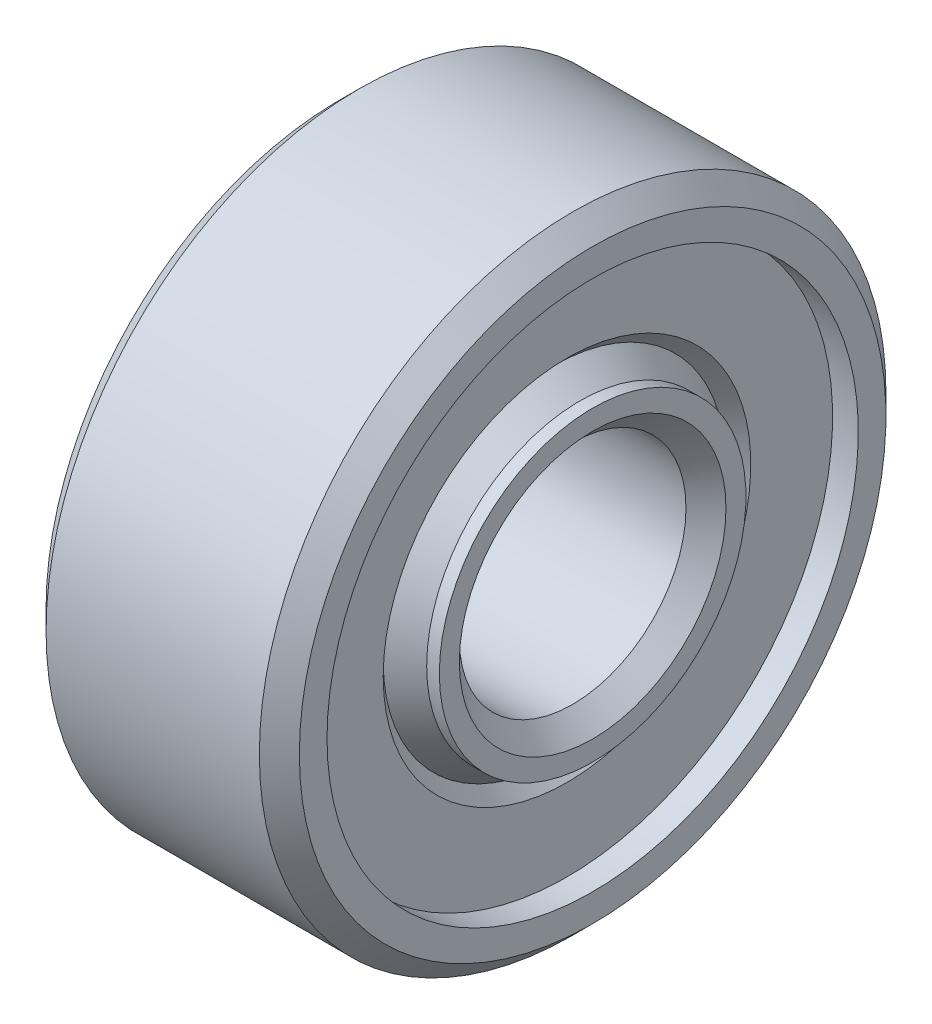
ISO-10303-21;
HEADER;
FILE_DESCRIPTION(('STEP AP214'),'2;1');
FILE_NAME('part.step','',(''),(''),'','','');
FILE_SCHEMA(('AUTOMOTIVE_DESIGN { 1 0 10303 214 1 1 1 1 }'));
ENDSEC;
DATA;
#1=APPLICATION_CONTEXT('core data for automotive mechanical design processes');
#2=APPLICATION_PROTOCOL_DEFINITION('international standard','automotive_design',2000,#1);
#3=PRODUCT_CONTEXT('',#1,'mechanical');
#4=PRODUCT('Part','Part','',(#3));
#5=PRODUCT_RELATED_PRODUCT_CATEGORY('part','',(#4));
#6=PRODUCT_DEFINITION_FORMATION('','',#4);
#7=PRODUCT_DEFINITION_CONTEXT('part definition',#1,'design');
#8=PRODUCT_DEFINITION('design','',#6,#7);
#9=PRODUCT_DEFINITION_SHAPE('','',#8);
#10=(LENGTH_UNIT() NAMED_UNIT(*) SI_UNIT(.MILLI.,.METRE.));
#11=(NAMED_UNIT(*) PLANE_ANGLE_UNIT() SI_UNIT($,.RADIAN.));
#12=(NAMED_UNIT(*) SI_UNIT($,.STERADIAN.) SOLID_ANGLE_UNIT());
#13=UNCERTAINTY_MEASURE_WITH_UNIT(LENGTH_MEASURE(1.E-05),#10,'distance_accuracy_value','');
#14=(GEOMETRIC_REPRESENTATION_CONTEXT(3) GLOBAL_UNCERTAINTY_ASSIGNED_CONTEXT((#13)) GLOBAL_UNIT_ASSIGNED_CONTEXT((#10,
#11,#12)) REPRESENTATION_CONTEXT('',''));
#15=CARTESIAN_POINT('',(0.,0.,0.));
#16=DIRECTION('',(0.,0.,1.));
#17=DIRECTION('',(1.,0.,0.));
#18=AXIS2_PLACEMENT_3D('',#15,#16,#17);
#19=CARTESIAN_POINT('',(16.125,-2.97038840172337,0.));
#20=DIRECTION('',(1.,0.,0.));
#21=DIRECTION('',(0.,0.,-1.));
#22=AXIS2_PLACEMENT_3D('',#19,#20,#21);
#23=PLANE('',#22);
#24=CARTESIAN_POINT('',(16.125,0.,0.));
#25=DIRECTION('',(-1.,0.,0.));
#26=DIRECTION('',(0.,0.,1.));
#27=AXIS2_PLACEMENT_3D('',#24,#25,#26);
#28=CIRCLE('',#27,12.8352601156069);
#29=CARTESIAN_POINT('',(16.125,0.,12.8352601156069));
#30=VERTEX_POINT('',#29);
#31=EDGE_CURVE('E11',#30,#30,#28,.T.);
#32=ORIENTED_EDGE('',*,*,#31,.F.);
#33=EDGE_LOOP('',(#32));
#34=FACE_BOUND('',#33,.T.);
#35=CARTESIAN_POINT('',(16.125,0.,0.));
#36=DIRECTION('',(-1.,0.,0.));
#37=DIRECTION('',(0.,0.,1.));
#38=AXIS2_PLACEMENT_3D('',#35,#36,#37);
#39=CIRCLE('',#38,19.925);
#40=CARTESIAN_POINT('',(16.125,0.,19.925));
#41=VERTEX_POINT('',#40);
#42=EDGE_CURVE('E55',#41,#41,#39,.T.);
#43=ORIENTED_EDGE('',*,*,#42,.T.);
#44=EDGE_LOOP('',(#43));
#45=FACE_BOUND('',#44,.T.);
#46=ADVANCED_FACE('F41',(#34,#45),#23,.F.);
#47=CARTESIAN_POINT('',(16.125,0.,0.));
#48=DIRECTION('',(1.,0.,0.));
#49=DIRECTION('',(0.,0.,-1.));
#50=AXIS2_PLACEMENT_3D('',#47,#48,#49);
#51=CONICAL_SURFACE('',#50,12.8352601156069,0.785398163397454);
#52=CARTESIAN_POINT('',(17.075,0.,0.));
#53=DIRECTION('',(-1.,0.,0.));
#54=DIRECTION('',(0.,0.,1.));
#55=AXIS2_PLACEMENT_3D('',#52,#53,#54);
#56=CIRCLE('',#55,13.785260115607);
#57=CARTESIAN_POINT('',(17.075,0.,13.785260115607));
#58=VERTEX_POINT('',#57);
#59=EDGE_CURVE('E47',#58,#58,#56,.T.);
#60=ORIENTED_EDGE('',*,*,#59,.F.);
#61=EDGE_LOOP('',(#60));
#62=FACE_BOUND('',#61,.T.);
#63=ORIENTED_EDGE('',*,*,#31,.T.);
#64=EDGE_LOOP('',(#63));
#65=FACE_BOUND('',#64,.T.);
#66=ADVANCED_FACE('F70',(#62,#65),#51,.F.);
#67=CARTESIAN_POINT('',(17.075,-2.97038840172337,0.));
#68=DIRECTION('',(1.,0.,0.));
#69=DIRECTION('',(0.,0.,-1.));
#70=AXIS2_PLACEMENT_3D('',#67,#68,#69);
#71=PLANE('',#70);
#72=ORIENTED_EDGE('',*,*,#59,.T.);
#73=EDGE_LOOP('',(#72));
#74=FACE_BOUND('',#73,.T.);
#75=CARTESIAN_POINT('',(17.075,0.,0.));
#76=DIRECTION('',(-1.,0.,0.));
#77=DIRECTION('',(0.,0.,1.));
#78=AXIS2_PLACEMENT_3D('',#75,#76,#77);
#79=CIRCLE('',#78,19.925);
#80=CARTESIAN_POINT('',(17.075,0.,19.925));
#81=VERTEX_POINT('',#80);
#82=EDGE_CURVE('E51',#81,#81,#79,.T.);
#83=ORIENTED_EDGE('',*,*,#82,.F.);
#84=EDGE_LOOP('',(#83));
#85=FACE_BOUND('',#84,.T.);
#86=ADVANCED_FACE('F64',(#74,#85),#71,.T.);
#87=CARTESIAN_POINT('',(0.,0.,0.));
#88=DIRECTION('',(-1.,0.,0.));
#89=DIRECTION('',(0.,0.,1.));
#90=AXIS2_PLACEMENT_3D('',#87,#88,#89);
#91=CYLINDRICAL_SURFACE('',#90,19.925);
#92=ORIENTED_EDGE('',*,*,#82,.T.);
#93=EDGE_LOOP('',(#92));
#94=FACE_BOUND('',#93,.T.);
#95=ORIENTED_EDGE('',*,*,#42,.F.);
#96=EDGE_LOOP('',(#95));
#97=FACE_BOUND('',#96,.T.);
#98=ADVANCED_FACE('F62',(#94,#97),#91,.T.);
#99=CLOSED_SHELL('',(#46,#66,#86,#98));
#100=MANIFOLD_SOLID_BREP('B2',#99);
#101=CARTESIAN_POINT('',(2.875,-2.97038840172337,0.));
#102=DIRECTION('',(1.,0.,0.));
#103=DIRECTION('',(0.,0.,-1.));
#104=AXIS2_PLACEMENT_3D('',#101,#102,#103);
#105=PLANE('',#104);
#106=CARTESIAN_POINT('',(2.875,0.,0.));
#107=DIRECTION('',(-1.,0.,0.));
#108=DIRECTION('',(0.,0.,1.));
#109=AXIS2_PLACEMENT_3D('',#106,#107,#108);
#110=CIRCLE('',#109,12.8352601156069);
#111=CARTESIAN_POINT('',(2.875,0.,12.8352601156069));
#112=VERTEX_POINT('',#111);
#113=EDGE_CURVE('E128',#112,#112,#110,.T.);
#114=ORIENTED_EDGE('',*,*,#113,.T.);
#115=EDGE_LOOP('',(#114));
#116=FACE_BOUND('',#115,.T.);
#117=CARTESIAN_POINT('',(2.875,0.,0.));
#118=DIRECTION('',(-1.,0.,0.));
#119=DIRECTION('',(0.,0.,1.));
#120=AXIS2_PLACEMENT_3D('',#117,#118,#119);
#121=CIRCLE('',#120,19.925);
#122=CARTESIAN_POINT('',(2.875,0.,19.925));
#123=VERTEX_POINT('',#122);
#124=EDGE_CURVE('E40',#123,#123,#121,.T.);
#125=ORIENTED_EDGE('',*,*,#124,.F.);
#126=EDGE_LOOP('',(#125));
#127=FACE_BOUND('',#126,.T.);
#128=ADVANCED_FACE('F114',(#116,#127),#105,.T.);
#129=CARTESIAN_POINT('',(0.,0.,0.));
#130=DIRECTION('',(-1.,0.,0.));
#131=DIRECTION('',(0.,0.,1.));
#132=AXIS2_PLACEMENT_3D('',#129,#130,#131);
#133=CYLINDRICAL_SURFACE('',#132,19.925);
#134=ORIENTED_EDGE('',*,*,#124,.T.);
#135=EDGE_LOOP('',(#134));
#136=FACE_BOUND('',#135,.T.);
#137=CARTESIAN_POINT('',(1.925,0.,0.));
#138=DIRECTION('',(-1.,0.,0.));
#139=DIRECTION('',(0.,0.,1.));
#140=AXIS2_PLACEMENT_3D('',#137,#138,#139);
#141=CIRCLE('',#140,19.925);
#142=CARTESIAN_POINT('',(1.925,0.,19.925));
#143=VERTEX_POINT('',#142);
#144=EDGE_CURVE('E120',#143,#143,#141,.T.);
#145=ORIENTED_EDGE('',*,*,#144,.F.);
#146=EDGE_LOOP('',(#145));
#147=FACE_BOUND('',#146,.T.);
#148=ADVANCED_FACE('F144',(#136,#147),#133,.T.);
#149=CARTESIAN_POINT('',(1.925,-2.97038840172337,0.));
#150=DIRECTION('',(1.,0.,0.));
#151=DIRECTION('',(0.,0.,-1.));
#152=AXIS2_PLACEMENT_3D('',#149,#150,#151);
#153=PLANE('',#152);
#154=CARTESIAN_POINT('',(1.925,0.,0.));
#155=DIRECTION('',(-1.,0.,0.));
#156=DIRECTION('',(0.,0.,1.));
#157=AXIS2_PLACEMENT_3D('',#154,#155,#156);
#158=CIRCLE('',#157,13.785260115607);
#159=CARTESIAN_POINT('',(1.925,0.,13.785260115607));
#160=VERTEX_POINT('',#159);
#161=EDGE_CURVE('E124',#160,#160,#158,.T.);
#162=ORIENTED_EDGE('',*,*,#161,.F.);
#163=EDGE_LOOP('',(#162));
#164=FACE_BOUND('',#163,.T.);
#165=ORIENTED_EDGE('',*,*,#144,.T.);
#166=EDGE_LOOP('',(#165));
#167=FACE_BOUND('',#166,.T.);
#168=ADVANCED_FACE('F139',(#164,#167),#153,.F.);
#169=CARTESIAN_POINT('',(1.925,0.,0.));
#170=DIRECTION('',(-1.,0.,0.));
#171=DIRECTION('',(0.,0.,1.));
#172=AXIS2_PLACEMENT_3D('',#169,#170,#171);
#173=CONICAL_SURFACE('',#172,13.785260115607,0.785398163397457);
#174=ORIENTED_EDGE('',*,*,#113,.F.);
#175=EDGE_LOOP('',(#174));
#176=FACE_BOUND('',#175,.T.);
#177=ORIENTED_EDGE('',*,*,#161,.T.);
#178=EDGE_LOOP('',(#177));
#179=FACE_BOUND('',#178,.T.);
#180=ADVANCED_FACE('F136',(#176,#179),#173,.F.);
#181=CLOSED_SHELL('',(#128,#148,#168,#180));
#182=MANIFOLD_SOLID_BREP('B6',#181);
#183=CARTESIAN_POINT('',(9.5,0.,0.));
#184=DIRECTION('',(-1.,0.,0.));
#185=DIRECTION('',(0.,0.,1.));
#186=AXIS2_PLACEMENT_3D('',#183,#184,#185);
#187=TOROIDAL_SURFACE('',#186,16.,3.75);
#188=CARTESIAN_POINT('',(9.5,0.,19.75));
#189=VERTEX_POINT('',#188);
#190=VERTEX_LOOP('',#189);
#191=FACE_BOUND('',#190,.T.);
#192=ADVANCED_FACE('F189',(#191),#187,.T.);
#193=CLOSED_SHELL('',(#192));
#194=MANIFOLD_SOLID_BREP('B35',#193);
#195=CARTESIAN_POINT('',(9.5,0.,0.));
#196=DIRECTION('',(-1.,0.,0.));
#197=DIRECTION('',(0.,0.,1.));
#198=AXIS2_PLACEMENT_3D('',#195,#196,#197);
#199=TOROIDAL_SURFACE('',#198,16.,3.75);
#200=CARTESIAN_POINT('',(12.2950849718747,0.,0.));
#201=DIRECTION('',(-1.,0.,0.));
#202=DIRECTION('',(0.,0.,1.));
#203=AXIS2_PLACEMENT_3D('',#200,#201,#202);
#204=CIRCLE('',#203,13.5);
#205=CARTESIAN_POINT('',(12.2950849718747,0.,13.5));
#206=VERTEX_POINT('',#205);
#207=EDGE_CURVE('E254',#206,#206,#204,.T.);
#208=ORIENTED_EDGE('',*,*,#207,.T.);
#209=EDGE_LOOP('',(#208));
#210=FACE_BOUND('',#209,.T.);
#211=CARTESIAN_POINT('',(6.70491502812526,0.,0.));
#212=DIRECTION('',(-1.,0.,0.));
#213=DIRECTION('',(0.,0.,1.));
#214=AXIS2_PLACEMENT_3D('',#211,#212,#213);
#215=CIRCLE('',#214,13.5);
#216=CARTESIAN_POINT('',(6.70491502812526,0.,13.5));
#217=VERTEX_POINT('',#216);
#218=EDGE_CURVE('E188',#217,#217,#215,.T.);
#219=ORIENTED_EDGE('',*,*,#218,.F.);
#220=EDGE_LOOP('',(#219));
#221=FACE_BOUND('',#220,.T.);
#222=ADVANCED_FACE('F214',(#210,#221),#199,.F.);
#223=CARTESIAN_POINT('',(0.,0.,0.));
#224=DIRECTION('',(-1.,0.,0.));
#225=DIRECTION('',(0.,0.,1.));
#226=AXIS2_PLACEMENT_3D('',#223,#224,#225);
#227=CYLINDRICAL_SURFACE('',#226,13.5);
#228=ORIENTED_EDGE('',*,*,#218,.T.);
#229=EDGE_LOOP('',(#228));
#230=FACE_BOUND('',#229,.T.);
#231=CARTESIAN_POINT('',(3.83333333333333,0.,0.));
#232=DIRECTION('',(-1.,0.,0.));
#233=DIRECTION('',(0.,0.,1.));
#234=AXIS2_PLACEMENT_3D('',#231,#232,#233);
#235=CIRCLE('',#234,13.5);
#236=CARTESIAN_POINT('',(3.83333333333333,0.,13.5));
#237=VERTEX_POINT('',#236);
#238=EDGE_CURVE('E220',#237,#237,#235,.T.);
#239=ORIENTED_EDGE('',*,*,#238,.F.);
#240=EDGE_LOOP('',(#239));
#241=FACE_BOUND('',#240,.T.);
#242=ADVANCED_FACE('F272',(#230,#241),#227,.T.);
#243=CARTESIAN_POINT('',(0.949999999999999,0.,0.));
#244=DIRECTION('',(1.,0.,0.));
#245=DIRECTION('',(0.,0.,-1.));
#246=AXIS2_PLACEMENT_3D('',#243,#244,#245);
#247=CONICAL_SURFACE('',#246,11.5,0.606445834884001);
#248=ORIENTED_EDGE('',*,*,#238,.T.);
#249=EDGE_LOOP('',(#248));
#250=FACE_BOUND('',#249,.T.);
#251=CARTESIAN_POINT('',(0.949999999999999,0.,0.));
#252=DIRECTION('',(-1.,0.,0.));
#253=DIRECTION('',(0.,0.,1.));
#254=AXIS2_PLACEMENT_3D('',#251,#252,#253);
#255=CIRCLE('',#254,11.5);
#256=CARTESIAN_POINT('',(0.949999999999999,0.,11.5));
#257=VERTEX_POINT('',#256);
#258=EDGE_CURVE('E224',#257,#257,#255,.T.);
#259=ORIENTED_EDGE('',*,*,#258,.F.);
#260=EDGE_LOOP('',(#259));
#261=FACE_BOUND('',#260,.T.);
#262=ADVANCED_FACE('F276',(#250,#261),#247,.T.);
#263=CARTESIAN_POINT('',(0.,0.,0.));
#264=DIRECTION('',(-1.,0.,0.));
#265=DIRECTION('',(0.,0.,1.));
#266=AXIS2_PLACEMENT_3D('',#263,#264,#265);
#267=CYLINDRICAL_SURFACE('',#266,11.5);
#268=ORIENTED_EDGE('',*,*,#258,.T.);
#269=EDGE_LOOP('',(#268));
#270=FACE_BOUND('',#269,.T.);
#271=CARTESIAN_POINT('',(0.,0.,0.));
#272=DIRECTION('',(-1.,0.,0.));
#273=DIRECTION('',(0.,0.,1.));
#274=AXIS2_PLACEMENT_3D('',#271,#272,#273);
#275=CIRCLE('',#274,11.5);
#276=CARTESIAN_POINT('',(0.,0.,11.5));
#277=VERTEX_POINT('',#276);
#278=EDGE_CURVE('E228',#277,#277,#275,.T.);
#279=ORIENTED_EDGE('',*,*,#278,.F.);
#280=EDGE_LOOP('',(#279));
#281=FACE_BOUND('',#280,.T.);
#282=ADVANCED_FACE('F280',(#270,#281),#267,.T.);
#283=CARTESIAN_POINT('',(0.,-2.97038840172337,0.));
#284=DIRECTION('',(-1.,0.,0.));
#285=DIRECTION('',(0.,0.,1.));
#286=AXIS2_PLACEMENT_3D('',#283,#284,#285);
#287=PLANE('',#286);
#288=ORIENTED_EDGE('',*,*,#278,.T.);
#289=EDGE_LOOP('',(#288));
#290=FACE_BOUND('',#289,.T.);
#291=CARTESIAN_POINT('',(0.,0.,0.));
#292=DIRECTION('',(-1.,0.,0.));
#293=DIRECTION('',(0.,0.,1.));
#294=AXIS2_PLACEMENT_3D('',#291,#292,#293);
#295=CIRCLE('',#294,9.99999999999999);
#296=CARTESIAN_POINT('',(0.,0.,9.99999999999999));
#297=VERTEX_POINT('',#296);
#298=EDGE_CURVE('E233',#297,#297,#295,.T.);
#299=ORIENTED_EDGE('',*,*,#298,.F.);
#300=EDGE_LOOP('',(#299));
#301=FACE_BOUND('',#300,.T.);
#302=ADVANCED_FACE('F286',(#290,#301),#287,.T.);
#303=CARTESIAN_POINT('',(0.,0.,0.));
#304=DIRECTION('',(-1.,0.,0.));
#305=DIRECTION('',(0.,0.,1.));
#306=AXIS2_PLACEMENT_3D('',#303,#304,#305);
#307=CONICAL_SURFACE('',#306,9.99999999999999,0.785398163397447);
#308=CARTESIAN_POINT('',(1.5,0.,0.));
#309=DIRECTION('',(-1.,0.,0.));
#310=DIRECTION('',(0.,0.,1.));
#311=AXIS2_PLACEMENT_3D('',#308,#309,#310);
#312=CIRCLE('',#311,8.5);
#313=CARTESIAN_POINT('',(1.5,0.,8.5));
#314=VERTEX_POINT('',#313);
#315=EDGE_CURVE('E236',#314,#314,#312,.T.);
#316=ORIENTED_EDGE('',*,*,#315,.F.);
#317=EDGE_LOOP('',(#316));
#318=FACE_BOUND('',#317,.T.);
#319=ORIENTED_EDGE('',*,*,#298,.T.);
#320=EDGE_LOOP('',(#319));
#321=FACE_BOUND('',#320,.T.);
#322=ADVANCED_FACE('F290',(#318,#321),#307,.F.);
#323=CARTESIAN_POINT('',(0.,0.,0.));
#324=DIRECTION('',(-1.,0.,0.));
#325=DIRECTION('',(0.,0.,1.));
#326=AXIS2_PLACEMENT_3D('',#323,#324,#325);
#327=CYLINDRICAL_SURFACE('',#326,8.5);
#328=CARTESIAN_POINT('',(17.5,0.,0.));
#329=DIRECTION('',(-1.,0.,0.));
#330=DIRECTION('',(0.,0.,1.));
#331=AXIS2_PLACEMENT_3D('',#328,#329,#330);
#332=CIRCLE('',#331,8.5);
#333=CARTESIAN_POINT('',(17.5,0.,8.5));
#334=VERTEX_POINT('',#333);
#335=EDGE_CURVE('E239',#334,#334,#332,.T.);
#336=ORIENTED_EDGE('',*,*,#335,.F.);
#337=EDGE_LOOP('',(#336));
#338=FACE_BOUND('',#337,.T.);
#339=ORIENTED_EDGE('',*,*,#315,.T.);
#340=EDGE_LOOP('',(#339));
#341=FACE_BOUND('',#340,.T.);
#342=ADVANCED_FACE('F294',(#338,#341),#327,.F.);
#343=CARTESIAN_POINT('',(17.5,0.,0.));
#344=DIRECTION('',(1.,0.,0.));
#345=DIRECTION('',(0.,0.,-1.));
#346=AXIS2_PLACEMENT_3D('',#343,#344,#345);
#347=CONICAL_SURFACE('',#346,8.5,0.78539816339745);
#348=CARTESIAN_POINT('',(19.,0.,0.));
#349=DIRECTION('',(-1.,0.,0.));
#350=DIRECTION('',(0.,0.,1.));
#351=AXIS2_PLACEMENT_3D('',#348,#349,#350);
#352=CIRCLE('',#351,10.);
#353=CARTESIAN_POINT('',(19.,0.,10.));
#354=VERTEX_POINT('',#353);
#355=EDGE_CURVE('E242',#354,#354,#352,.T.);
#356=ORIENTED_EDGE('',*,*,#355,.F.);
#357=EDGE_LOOP('',(#356));
#358=FACE_BOUND('',#357,.T.);
#359=ORIENTED_EDGE('',*,*,#335,.T.);
#360=EDGE_LOOP('',(#359));
#361=FACE_BOUND('',#360,.T.);
#362=ADVANCED_FACE('F298',(#358,#361),#347,.F.);
#363=CARTESIAN_POINT('',(19.,-2.97038840172337,0.));
#364=DIRECTION('',(-1.,0.,0.));
#365=DIRECTION('',(0.,0.,1.));
#366=AXIS2_PLACEMENT_3D('',#363,#364,#365);
#367=PLANE('',#366);
#368=CARTESIAN_POINT('',(19.,0.,0.));
#369=DIRECTION('',(-1.,0.,0.));
#370=DIRECTION('',(0.,0.,1.));
#371=AXIS2_PLACEMENT_3D('',#368,#369,#370);
#372=CIRCLE('',#371,11.5);
#373=CARTESIAN_POINT('',(19.,0.,11.5));
#374=VERTEX_POINT('',#373);
#375=EDGE_CURVE('E245',#374,#374,#372,.T.);
#376=ORIENTED_EDGE('',*,*,#375,.F.);
#377=EDGE_LOOP('',(#376));
#378=FACE_BOUND('',#377,.T.);
#379=ORIENTED_EDGE('',*,*,#355,.T.);
#380=EDGE_LOOP('',(#379));
#381=FACE_BOUND('',#380,.T.);
#382=ADVANCED_FACE('F302',(#378,#381),#367,.F.);
#383=CARTESIAN_POINT('',(0.,0.,0.));
#384=DIRECTION('',(-1.,0.,0.));
#385=DIRECTION('',(0.,0.,1.));
#386=AXIS2_PLACEMENT_3D('',#383,#384,#385);
#387=CYLINDRICAL_SURFACE('',#386,11.5);
#388=ORIENTED_EDGE('',*,*,#375,.T.);
#389=EDGE_LOOP('',(#388));
#390=FACE_BOUND('',#389,.T.);
#391=CARTESIAN_POINT('',(18.05,0.,0.));
#392=DIRECTION('',(-1.,0.,0.));
#393=DIRECTION('',(0.,0.,1.));
#394=AXIS2_PLACEMENT_3D('',#391,#392,#393);
#395=CIRCLE('',#394,11.5);
#396=CARTESIAN_POINT('',(18.05,0.,11.5));
#397=VERTEX_POINT('',#396);
#398=EDGE_CURVE('E248',#397,#397,#395,.T.);
#399=ORIENTED_EDGE('',*,*,#398,.F.);
#400=EDGE_LOOP('',(#399));
#401=FACE_BOUND('',#400,.T.);
#402=ADVANCED_FACE('F268',(#390,#401),#387,.T.);
#403=CARTESIAN_POINT('',(15.1666666666667,0.,0.));
#404=DIRECTION('',(-1.,0.,0.));
#405=DIRECTION('',(0.,0.,1.));
#406=AXIS2_PLACEMENT_3D('',#403,#404,#405);
#407=CONICAL_SURFACE('',#406,13.5,0.606445834884);
#408=ORIENTED_EDGE('',*,*,#398,.T.);
#409=EDGE_LOOP('',(#408));
#410=FACE_BOUND('',#409,.T.);
#411=CARTESIAN_POINT('',(15.1666666666667,0.,0.));
#412=DIRECTION('',(-1.,0.,0.));
#413=DIRECTION('',(0.,0.,1.));
#414=AXIS2_PLACEMENT_3D('',#411,#412,#413);
#415=CIRCLE('',#414,13.5);
#416=CARTESIAN_POINT('',(15.1666666666667,0.,13.5));
#417=VERTEX_POINT('',#416);
#418=EDGE_CURVE('E251',#417,#417,#415,.T.);
#419=ORIENTED_EDGE('',*,*,#418,.F.);
#420=EDGE_LOOP('',(#419));
#421=FACE_BOUND('',#420,.T.);
#422=ADVANCED_FACE('F262',(#410,#421),#407,.T.);
#423=CARTESIAN_POINT('',(0.,0.,0.));
#424=DIRECTION('',(-1.,0.,0.));
#425=DIRECTION('',(0.,0.,1.));
#426=AXIS2_PLACEMENT_3D('',#423,#424,#425);
#427=CYLINDRICAL_SURFACE('',#426,13.5);
#428=ORIENTED_EDGE('',*,*,#418,.T.);
#429=EDGE_LOOP('',(#428));
#430=FACE_BOUND('',#429,.T.);
#431=ORIENTED_EDGE('',*,*,#207,.F.);
#432=EDGE_LOOP('',(#431));
#433=FACE_BOUND('',#432,.T.);
#434=ADVANCED_FACE('F260',(#430,#433),#427,.T.);
#435=CLOSED_SHELL('',(#222,#242,#262,#282,#302,#322,#342,#362,#382,#402,#422,#434));
#436=MANIFOLD_SOLID_BREP('B110',#435);
#437=CARTESIAN_POINT('',(9.5,0.,0.));
#438=DIRECTION('',(-1.,0.,0.));
#439=DIRECTION('',(0.,0.,1.));
#440=AXIS2_PLACEMENT_3D('',#437,#438,#439);
#441=TOROIDAL_SURFACE('',#440,16.,3.75);
#442=CARTESIAN_POINT('',(6.70491502812526,0.,0.));
#443=DIRECTION('',(-1.,0.,0.));
#444=DIRECTION('',(0.,0.,1.));
#445=AXIS2_PLACEMENT_3D('',#442,#443,#444);
#446=CIRCLE('',#445,18.5);
#447=CARTESIAN_POINT('',(6.70491502812526,0.,18.5));
#448=VERTEX_POINT('',#447);
#449=EDGE_CURVE('E438',#448,#448,#446,.T.);
#450=ORIENTED_EDGE('',*,*,#449,.T.);
#451=EDGE_LOOP('',(#450));
#452=FACE_BOUND('',#451,.T.);
#453=CARTESIAN_POINT('',(12.2950849718747,0.,0.));
#454=DIRECTION('',(-1.,0.,0.));
#455=DIRECTION('',(0.,0.,1.));
#456=AXIS2_PLACEMENT_3D('',#453,#454,#455);
#457=CIRCLE('',#456,18.5);
#458=CARTESIAN_POINT('',(12.2950849718747,0.,18.5));
#459=VERTEX_POINT('',#458);
#460=EDGE_CURVE('E213',#459,#459,#457,.T.);
#461=ORIENTED_EDGE('',*,*,#460,.F.);
#462=EDGE_LOOP('',(#461));
#463=FACE_BOUND('',#462,.T.);
#464=ADVANCED_FACE('F398',(#452,#463),#441,.F.);
#465=CARTESIAN_POINT('',(0.,0.,0.));
#466=DIRECTION('',(-1.,0.,0.));
#467=DIRECTION('',(0.,0.,1.));
#468=AXIS2_PLACEMENT_3D('',#465,#466,#467);
#469=CYLINDRICAL_SURFACE('',#468,18.5);
#470=CARTESIAN_POINT('',(16.125,0.,0.));
#471=DIRECTION('',(-1.,0.,0.));
#472=DIRECTION('',(0.,0.,1.));
#473=AXIS2_PLACEMENT_3D('',#470,#471,#472);
#474=CIRCLE('',#473,18.5);
#475=CARTESIAN_POINT('',(16.125,0.,18.5));
#476=VERTEX_POINT('',#475);
#477=EDGE_CURVE('E404',#476,#476,#474,.T.);
#478=ORIENTED_EDGE('',*,*,#477,.F.);
#479=EDGE_LOOP('',(#478));
#480=FACE_BOUND('',#479,.T.);
#481=ORIENTED_EDGE('',*,*,#460,.T.);
#482=EDGE_LOOP('',(#481));
#483=FACE_BOUND('',#482,.T.);
#484=ADVANCED_FACE('F474',(#480,#483),#469,.F.);
#485=CARTESIAN_POINT('',(16.125,-2.97038840172337,0.));
#486=DIRECTION('',(1.,0.,0.));
#487=DIRECTION('',(0.,0.,-1.));
#488=AXIS2_PLACEMENT_3D('',#485,#486,#487);
#489=PLANE('',#488);
#490=ORIENTED_EDGE('',*,*,#477,.T.);
#491=EDGE_LOOP('',(#490));
#492=FACE_BOUND('',#491,.T.);
#493=CARTESIAN_POINT('',(16.125,0.,0.));
#494=DIRECTION('',(-1.,0.,0.));
#495=DIRECTION('',(0.,0.,1.));
#496=AXIS2_PLACEMENT_3D('',#493,#494,#495);
#497=CIRCLE('',#496,19.925);
#498=CARTESIAN_POINT('',(16.125,0.,19.925));
#499=VERTEX_POINT('',#498);
#500=EDGE_CURVE('E408',#499,#499,#497,.T.);
#501=ORIENTED_EDGE('',*,*,#500,.F.);
#502=EDGE_LOOP('',(#501));
#503=FACE_BOUND('',#502,.T.);
#504=ADVANCED_FACE('F478',(#492,#503),#489,.T.);
#505=CARTESIAN_POINT('',(0.,0.,0.));
#506=DIRECTION('',(-1.,0.,0.));
#507=DIRECTION('',(0.,0.,1.));
#508=AXIS2_PLACEMENT_3D('',#505,#506,#507);
#509=CYLINDRICAL_SURFACE('',#508,19.925);
#510=CARTESIAN_POINT('',(19.,0.,0.));
#511=DIRECTION('',(-1.,0.,0.));
#512=DIRECTION('',(0.,0.,1.));
#513=AXIS2_PLACEMENT_3D('',#510,#511,#512);
#514=CIRCLE('',#513,19.925);
#515=CARTESIAN_POINT('',(19.,0.,19.925));
#516=VERTEX_POINT('',#515);
#517=EDGE_CURVE('E412',#516,#516,#514,.T.);
#518=ORIENTED_EDGE('',*,*,#517,.F.);
#519=EDGE_LOOP('',(#518));
#520=FACE_BOUND('',#519,.T.);
#521=ORIENTED_EDGE('',*,*,#500,.T.);
#522=EDGE_LOOP('',(#521));
#523=FACE_BOUND('',#522,.T.);
#524=ADVANCED_FACE('F483',(#520,#523),#509,.F.);
#525=CARTESIAN_POINT('',(19.,-2.97038840172338,0.));
#526=DIRECTION('',(-1.,0.,0.));
#527=DIRECTION('',(0.,0.,1.));
#528=AXIS2_PLACEMENT_3D('',#525,#526,#527);
#529=PLANE('',#528);
#530=CARTESIAN_POINT('',(19.,0.,0.));
#531=DIRECTION('',(-1.,0.,0.));
#532=DIRECTION('',(0.,0.,1.));
#533=AXIS2_PLACEMENT_3D('',#530,#531,#532);
#534=CIRCLE('',#533,22.);
#535=CARTESIAN_POINT('',(19.,0.,22.));
#536=VERTEX_POINT('',#535);
#537=EDGE_CURVE('E417',#536,#536,#534,.T.);
#538=ORIENTED_EDGE('',*,*,#537,.F.);
#539=EDGE_LOOP('',(#538));
#540=FACE_BOUND('',#539,.T.);
#541=ORIENTED_EDGE('',*,*,#517,.T.);
#542=EDGE_LOOP('',(#541));
#543=FACE_BOUND('',#542,.T.);
#544=ADVANCED_FACE('F488',(#540,#543),#529,.F.);
#545=CARTESIAN_POINT('',(17.5,0.,0.));
#546=DIRECTION('',(-1.,0.,0.));
#547=DIRECTION('',(0.,0.,1.));
#548=AXIS2_PLACEMENT_3D('',#545,#546,#547);
#549=CONICAL_SURFACE('',#548,23.5,0.785398163397446);
#550=ORIENTED_EDGE('',*,*,#537,.T.);
#551=EDGE_LOOP('',(#550));
#552=FACE_BOUND('',#551,.T.);
#553=CARTESIAN_POINT('',(17.5,0.,0.));
#554=DIRECTION('',(-1.,0.,0.));
#555=DIRECTION('',(0.,0.,1.));
#556=AXIS2_PLACEMENT_3D('',#553,#554,#555);
#557=CIRCLE('',#556,23.5);
#558=CARTESIAN_POINT('',(17.5,0.,23.5));
#559=VERTEX_POINT('',#558);
#560=EDGE_CURVE('E420',#559,#559,#557,.T.);
#561=ORIENTED_EDGE('',*,*,#560,.F.);
#562=EDGE_LOOP('',(#561));
#563=FACE_BOUND('',#562,.T.);
#564=ADVANCED_FACE('F492',(#552,#563),#549,.T.);
#565=CARTESIAN_POINT('',(0.,0.,0.));
#566=DIRECTION('',(-1.,0.,0.));
#567=DIRECTION('',(0.,0.,1.));
#568=AXIS2_PLACEMENT_3D('',#565,#566,#567);
#569=CYLINDRICAL_SURFACE('',#568,23.5);
#570=ORIENTED_EDGE('',*,*,#560,.T.);
#571=EDGE_LOOP('',(#570));
#572=FACE_BOUND('',#571,.T.);
#573=CARTESIAN_POINT('',(1.50000000000003,0.,0.));
#574=DIRECTION('',(-1.,0.,0.));
#575=DIRECTION('',(0.,0.,1.));
#576=AXIS2_PLACEMENT_3D('',#573,#574,#575);
#577=CIRCLE('',#576,23.5);
#578=CARTESIAN_POINT('',(1.50000000000003,0.,23.5));
#579=VERTEX_POINT('',#578);
#580=EDGE_CURVE('E423',#579,#579,#577,.T.);
#581=ORIENTED_EDGE('',*,*,#580,.F.);
#582=EDGE_LOOP('',(#581));
#583=FACE_BOUND('',#582,.T.);
#584=ADVANCED_FACE('F470',(#572,#583),#569,.T.);
#585=CARTESIAN_POINT('',(0.,0.,0.));
#586=DIRECTION('',(1.,0.,0.));
#587=DIRECTION('',(0.,0.,-1.));
#588=AXIS2_PLACEMENT_3D('',#585,#586,#587);
#589=CONICAL_SURFACE('',#588,22.,0.785398163397445);
#590=ORIENTED_EDGE('',*,*,#580,.T.);
#591=EDGE_LOOP('',(#590));
#592=FACE_BOUND('',#591,.T.);
#593=CARTESIAN_POINT('',(0.,0.,0.));
#594=DIRECTION('',(-1.,0.,0.));
#595=DIRECTION('',(0.,0.,1.));
#596=AXIS2_PLACEMENT_3D('',#593,#594,#595);
#597=CIRCLE('',#596,22.);
#598=CARTESIAN_POINT('',(0.,0.,22.));
#599=VERTEX_POINT('',#598);
#600=EDGE_CURVE('E426',#599,#599,#597,.T.);
#601=ORIENTED_EDGE('',*,*,#600,.F.);
#602=EDGE_LOOP('',(#601));
#603=FACE_BOUND('',#602,.T.);
#604=ADVANCED_FACE('F464',(#592,#603),#589,.T.);
#605=CARTESIAN_POINT('',(0.,-2.97038840172337,0.));
#606=DIRECTION('',(-1.,0.,0.));
#607=DIRECTION('',(0.,0.,1.));
#608=AXIS2_PLACEMENT_3D('',#605,#606,#607);
#609=PLANE('',#608);
#610=ORIENTED_EDGE('',*,*,#600,.T.);
#611=EDGE_LOOP('',(#610));
#612=FACE_BOUND('',#611,.T.);
#613=CARTESIAN_POINT('',(0.,0.,0.));
#614=DIRECTION('',(-1.,0.,0.));
#615=DIRECTION('',(0.,0.,1.));
#616=AXIS2_PLACEMENT_3D('',#613,#614,#615);
#617=CIRCLE('',#616,19.925);
#618=CARTESIAN_POINT('',(0.,0.,19.925));
#619=VERTEX_POINT('',#618);
#620=EDGE_CURVE('E429',#619,#619,#617,.T.);
#621=ORIENTED_EDGE('',*,*,#620,.F.);
#622=EDGE_LOOP('',(#621));
#623=FACE_BOUND('',#622,.T.);
#624=ADVANCED_FACE('F459',(#612,#623),#609,.T.);
#625=CARTESIAN_POINT('',(0.,0.,0.));
#626=DIRECTION('',(-1.,0.,0.));
#627=DIRECTION('',(0.,0.,1.));
#628=AXIS2_PLACEMENT_3D('',#625,#626,#627);
#629=CYLINDRICAL_SURFACE('',#628,19.925);
#630=CARTESIAN_POINT('',(2.875,0.,0.));
#631=DIRECTION('',(-1.,0.,0.));
#632=DIRECTION('',(0.,0.,1.));
#633=AXIS2_PLACEMENT_3D('',#630,#631,#632);
#634=CIRCLE('',#633,19.925);
#635=CARTESIAN_POINT('',(2.875,0.,19.925));
#636=VERTEX_POINT('',#635);
#637=EDGE_CURVE('E432',#636,#636,#634,.T.);
#638=ORIENTED_EDGE('',*,*,#637,.F.);
#639=EDGE_LOOP('',(#638));
#640=FACE_BOUND('',#639,.T.);
#641=ORIENTED_EDGE('',*,*,#620,.T.);
#642=EDGE_LOOP('',(#641));
#643=FACE_BOUND('',#642,.T.);
#644=ADVANCED_FACE('F453',(#640,#643),#629,.F.);
#645=CARTESIAN_POINT('',(2.875,-2.97038840172337,0.));
#646=DIRECTION('',(1.,0.,0.));
#647=DIRECTION('',(0.,0.,-1.));
#648=AXIS2_PLACEMENT_3D('',#645,#646,#647);
#649=PLANE('',#648);
#650=CARTESIAN_POINT('',(2.875,0.,0.));
#651=DIRECTION('',(-1.,0.,0.));
#652=DIRECTION('',(0.,0.,1.));
#653=AXIS2_PLACEMENT_3D('',#650,#651,#652);
#654=CIRCLE('',#653,18.5);
#655=CARTESIAN_POINT('',(2.875,0.,18.5));
#656=VERTEX_POINT('',#655);
#657=EDGE_CURVE('E435',#656,#656,#654,.T.);
#658=ORIENTED_EDGE('',*,*,#657,.F.);
#659=EDGE_LOOP('',(#658));
#660=FACE_BOUND('',#659,.T.);
#661=ORIENTED_EDGE('',*,*,#637,.T.);
#662=EDGE_LOOP('',(#661));
#663=FACE_BOUND('',#662,.T.);
#664=ADVANCED_FACE('F447',(#660,#663),#649,.F.);
#665=CARTESIAN_POINT('',(0.,0.,0.));
#666=DIRECTION('',(-1.,0.,0.));
#667=DIRECTION('',(0.,0.,1.));
#668=AXIS2_PLACEMENT_3D('',#665,#666,#667);
#669=CYLINDRICAL_SURFACE('',#668,18.5);
#670=ORIENTED_EDGE('',*,*,#449,.F.);
#671=EDGE_LOOP('',(#670));
#672=FACE_BOUND('',#671,.T.);
#673=ORIENTED_EDGE('',*,*,#657,.T.);
#674=EDGE_LOOP('',(#673));
#675=FACE_BOUND('',#674,.T.);
#676=ADVANCED_FACE('F444',(#672,#675),#669,.F.);
#677=CLOSED_SHELL('',(#464,#484,#504,#524,#544,#564,#584,#604,#624,#644,#664,#676));
#678=MANIFOLD_SOLID_BREP('B183',#677);
#679=ADVANCED_BREP_SHAPE_REPRESENTATION('',(#18,#100,#182,#194,#436,#678),#14);
#680=SHAPE_DEFINITION_REPRESENTATION(#9,#679);
ENDSEC;
END-ISO-10303-21;
